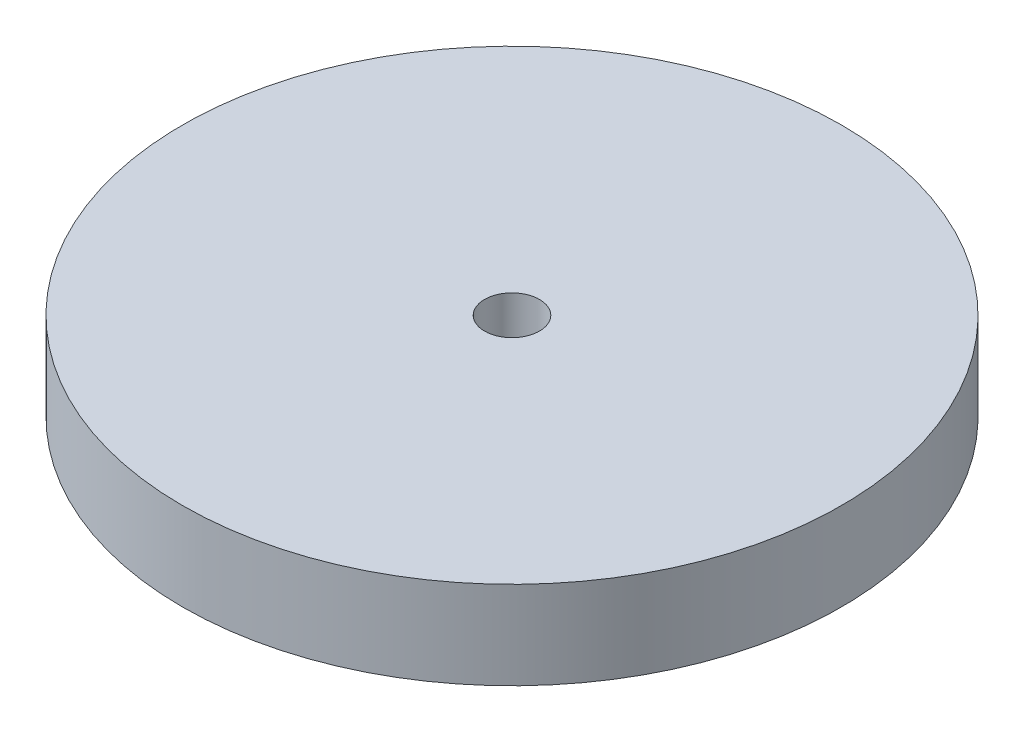
ISO-10303-21;
HEADER;
FILE_DESCRIPTION(('STEP AP214'),'2;1');
FILE_NAME('part.step','',(''),(''),'','','');
FILE_SCHEMA(('AUTOMOTIVE_DESIGN { 1 0 10303 214 1 1 1 1 }'));
ENDSEC;
DATA;
#1=APPLICATION_CONTEXT('core data for automotive mechanical design processes');
#2=APPLICATION_PROTOCOL_DEFINITION('international standard','automotive_design',2000,#1);
#3=PRODUCT_CONTEXT('',#1,'mechanical');
#4=PRODUCT('Part','Part','',(#3));
#5=PRODUCT_RELATED_PRODUCT_CATEGORY('part','',(#4));
#6=PRODUCT_DEFINITION_FORMATION('','',#4);
#7=PRODUCT_DEFINITION_CONTEXT('part definition',#1,'design');
#8=PRODUCT_DEFINITION('design','',#6,#7);
#9=PRODUCT_DEFINITION_SHAPE('','',#8);
#10=(LENGTH_UNIT() NAMED_UNIT(*) SI_UNIT(.MILLI.,.METRE.));
#11=(NAMED_UNIT(*) PLANE_ANGLE_UNIT() SI_UNIT($,.RADIAN.));
#12=(NAMED_UNIT(*) SI_UNIT($,.STERADIAN.) SOLID_ANGLE_UNIT());
#13=UNCERTAINTY_MEASURE_WITH_UNIT(LENGTH_MEASURE(1.E-05),#10,'distance_accuracy_value','');
#14=(GEOMETRIC_REPRESENTATION_CONTEXT(3) GLOBAL_UNCERTAINTY_ASSIGNED_CONTEXT((#13)) GLOBAL_UNIT_ASSIGNED_CONTEXT((#10,
#11,#12)) REPRESENTATION_CONTEXT('',''));
#15=CARTESIAN_POINT('',(0.,0.,0.));
#16=DIRECTION('',(0.,0.,1.));
#17=DIRECTION('',(1.,0.,0.));
#18=AXIS2_PLACEMENT_3D('',#15,#16,#17);
#19=CARTESIAN_POINT('',(0.,8.,0.));
#20=DIRECTION('',(0.,-1.,0.));
#21=DIRECTION('',(0.,0.,-1.));
#22=AXIS2_PLACEMENT_3D('',#19,#20,#21);
#23=CYLINDRICAL_SURFACE('',#22,30.);
#24=CARTESIAN_POINT('',(0.,8.,0.));
#25=DIRECTION('',(0.,1.,0.));
#26=DIRECTION('',(0.,0.,1.));
#27=AXIS2_PLACEMENT_3D('',#24,#25,#26);
#28=CIRCLE('',#27,30.);
#29=CARTESIAN_POINT('',(0.,8.,30.));
#30=VERTEX_POINT('',#29);
#31=EDGE_CURVE('E10',#30,#30,#28,.T.);
#32=ORIENTED_EDGE('',*,*,#31,.F.);
#33=EDGE_LOOP('',(#32));
#34=FACE_BOUND('',#33,.T.);
#35=CARTESIAN_POINT('',(0.,0.,0.));
#36=DIRECTION('',(0.,1.,0.));
#37=DIRECTION('',(0.,0.,1.));
#38=AXIS2_PLACEMENT_3D('',#35,#36,#37);
#39=CIRCLE('',#38,30.);
#40=CARTESIAN_POINT('',(0.,0.,30.));
#41=VERTEX_POINT('',#40);
#42=EDGE_CURVE('E38',#41,#41,#39,.T.);
#43=ORIENTED_EDGE('',*,*,#42,.T.);
#44=EDGE_LOOP('',(#43));
#45=FACE_BOUND('',#44,.T.);
#46=ADVANCED_FACE('F31',(#34,#45),#23,.T.);
#47=CARTESIAN_POINT('',(0.,8.,0.));
#48=DIRECTION('',(0.,1.,0.));
#49=DIRECTION('',(0.,0.,1.));
#50=AXIS2_PLACEMENT_3D('',#47,#48,#49);
#51=PLANE('',#50);
#52=CARTESIAN_POINT('',(0.,8.,0.));
#53=DIRECTION('',(0.,1.,0.));
#54=DIRECTION('',(0.,0.,1.));
#55=AXIS2_PLACEMENT_3D('',#52,#53,#54);
#56=CIRCLE('',#55,2.5);
#57=CARTESIAN_POINT('',(0.,8.,2.5));
#58=VERTEX_POINT('',#57);
#59=EDGE_CURVE('E44',#58,#58,#56,.T.);
#60=ORIENTED_EDGE('',*,*,#59,.F.);
#61=EDGE_LOOP('',(#60));
#62=FACE_BOUND('',#61,.T.);
#63=ORIENTED_EDGE('',*,*,#31,.T.);
#64=EDGE_LOOP('',(#63));
#65=FACE_BOUND('',#64,.T.);
#66=ADVANCED_FACE('F60',(#62,#65),#51,.T.);
#67=CARTESIAN_POINT('',(0.,0.,0.));
#68=DIRECTION('',(0.,1.,0.));
#69=DIRECTION('',(0.,0.,1.));
#70=AXIS2_PLACEMENT_3D('',#67,#68,#69);
#71=PLANE('',#70);
#72=CARTESIAN_POINT('',(0.,0.,0.));
#73=DIRECTION('',(0.,1.,0.));
#74=DIRECTION('',(0.,0.,1.));
#75=AXIS2_PLACEMENT_3D('',#72,#73,#74);
#76=CIRCLE('',#75,2.5);
#77=CARTESIAN_POINT('',(0.,0.,2.5));
#78=VERTEX_POINT('',#77);
#79=EDGE_CURVE('E34',#78,#78,#76,.T.);
#80=ORIENTED_EDGE('',*,*,#79,.T.);
#81=EDGE_LOOP('',(#80));
#82=FACE_BOUND('',#81,.T.);
#83=ORIENTED_EDGE('',*,*,#42,.F.);
#84=EDGE_LOOP('',(#83));
#85=FACE_BOUND('',#84,.T.);
#86=ADVANCED_FACE('F51',(#82,#85),#71,.F.);
#87=CARTESIAN_POINT('',(0.,-2.,0.));
#88=DIRECTION('',(0.,1.,0.));
#89=DIRECTION('',(0.,0.,1.));
#90=AXIS2_PLACEMENT_3D('',#87,#88,#89);
#91=CYLINDRICAL_SURFACE('',#90,2.5);
#92=ORIENTED_EDGE('',*,*,#59,.T.);
#93=EDGE_LOOP('',(#92));
#94=FACE_BOUND('',#93,.T.);
#95=ORIENTED_EDGE('',*,*,#79,.F.);
#96=EDGE_LOOP('',(#95));
#97=FACE_BOUND('',#96,.T.);
#98=ADVANCED_FACE('F54',(#94,#97),#91,.F.);
#99=CLOSED_SHELL('',(#46,#66,#86,#98));
#100=MANIFOLD_SOLID_BREP('B2',#99);
#101=ADVANCED_BREP_SHAPE_REPRESENTATION('',(#18,#100),#14);
#102=SHAPE_DEFINITION_REPRESENTATION(#9,#101);
ENDSEC;
END-ISO-10303-21;
